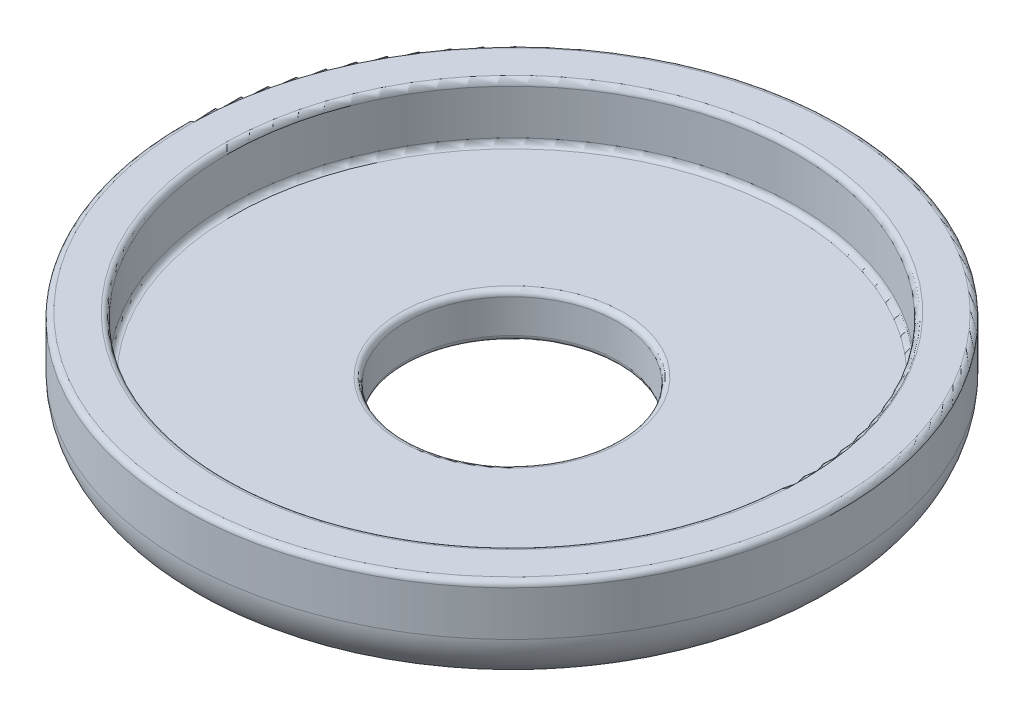
ISO-10303-21;
HEADER;
FILE_DESCRIPTION(('STEP AP214'),'2;1');
FILE_NAME('part.step','',(''),(''),'','','');
FILE_SCHEMA(('AUTOMOTIVE_DESIGN { 1 0 10303 214 1 1 1 1 }'));
ENDSEC;
DATA;
#1=APPLICATION_CONTEXT('core data for automotive mechanical design processes');
#2=APPLICATION_PROTOCOL_DEFINITION('international standard','automotive_design',2000,#1);
#3=PRODUCT_CONTEXT('',#1,'mechanical');
#4=PRODUCT('Part','Part','',(#3));
#5=PRODUCT_RELATED_PRODUCT_CATEGORY('part','',(#4));
#6=PRODUCT_DEFINITION_FORMATION('','',#4);
#7=PRODUCT_DEFINITION_CONTEXT('part definition',#1,'design');
#8=PRODUCT_DEFINITION('design','',#6,#7);
#9=PRODUCT_DEFINITION_SHAPE('','',#8);
#10=(LENGTH_UNIT() NAMED_UNIT(*) SI_UNIT(.MILLI.,.METRE.));
#11=(NAMED_UNIT(*) PLANE_ANGLE_UNIT() SI_UNIT($,.RADIAN.));
#12=(NAMED_UNIT(*) SI_UNIT($,.STERADIAN.) SOLID_ANGLE_UNIT());
#13=UNCERTAINTY_MEASURE_WITH_UNIT(LENGTH_MEASURE(1.E-05),#10,'distance_accuracy_value','');
#14=(GEOMETRIC_REPRESENTATION_CONTEXT(3) GLOBAL_UNCERTAINTY_ASSIGNED_CONTEXT((#13)) GLOBAL_UNIT_ASSIGNED_CONTEXT((#10,
#11,#12)) REPRESENTATION_CONTEXT('',''));
#15=CARTESIAN_POINT('',(0.,0.,0.));
#16=DIRECTION('',(0.,0.,1.));
#17=DIRECTION('',(1.,0.,0.));
#18=AXIS2_PLACEMENT_3D('',#15,#16,#17);
#19=CARTESIAN_POINT('',(0.,2.25,0.));
#20=DIRECTION('',(0.,-1.,0.));
#21=DIRECTION('',(0.,0.,-1.));
#22=AXIS2_PLACEMENT_3D('',#19,#20,#21);
#23=TOROIDAL_SURFACE('',#22,12.5,2.25);
#24=CARTESIAN_POINT('',(0.,2.25,0.));
#25=DIRECTION('',(0.,-1.,0.));
#26=DIRECTION('',(0.,0.,-1.));
#27=AXIS2_PLACEMENT_3D('',#24,#25,#26);
#28=CIRCLE('',#27,14.75);
#29=CARTESIAN_POINT('',(0.,2.25,-14.75));
#30=VERTEX_POINT('',#29);
#31=EDGE_CURVE('E10',#30,#30,#28,.T.);
#32=ORIENTED_EDGE('',*,*,#31,.T.);
#33=EDGE_LOOP('',(#32));
#34=FACE_BOUND('',#33,.T.);
#35=CARTESIAN_POINT('',(0.,0.,0.));
#36=DIRECTION('',(0.,-1.,0.));
#37=DIRECTION('',(0.,0.,-1.));
#38=AXIS2_PLACEMENT_3D('',#35,#36,#37);
#39=CIRCLE('',#38,12.5);
#40=CARTESIAN_POINT('',(0.,0.,-12.5));
#41=VERTEX_POINT('',#40);
#42=EDGE_CURVE('E72',#41,#41,#39,.T.);
#43=ORIENTED_EDGE('',*,*,#42,.F.);
#44=EDGE_LOOP('',(#43));
#45=FACE_BOUND('',#44,.T.);
#46=ADVANCED_FACE('F32',(#34,#45),#23,.T.);
#47=CARTESIAN_POINT('',(0.,0.,0.));
#48=DIRECTION('',(0.,-1.,0.));
#49=DIRECTION('',(0.,0.,-1.));
#50=AXIS2_PLACEMENT_3D('',#47,#48,#49);
#51=CYLINDRICAL_SURFACE('',#50,14.75);
#52=CARTESIAN_POINT('',(0.,4.25,0.));
#53=DIRECTION('',(0.,-1.,0.));
#54=DIRECTION('',(0.,0.,-1.));
#55=AXIS2_PLACEMENT_3D('',#52,#53,#54);
#56=CIRCLE('',#55,14.75);
#57=CARTESIAN_POINT('',(0.,4.25,-14.75));
#58=VERTEX_POINT('',#57);
#59=EDGE_CURVE('E38',#58,#58,#56,.T.);
#60=ORIENTED_EDGE('',*,*,#59,.T.);
#61=EDGE_LOOP('',(#60));
#62=FACE_BOUND('',#61,.T.);
#63=ORIENTED_EDGE('',*,*,#31,.F.);
#64=EDGE_LOOP('',(#63));
#65=FACE_BOUND('',#64,.T.);
#66=ADVANCED_FACE('F81',(#62,#65),#51,.T.);
#67=CARTESIAN_POINT('',(0.,4.25,0.));
#68=DIRECTION('',(0.,-1.,0.));
#69=DIRECTION('',(0.,0.,-1.));
#70=AXIS2_PLACEMENT_3D('',#67,#68,#69);
#71=TOROIDAL_SURFACE('',#70,14.5,0.25);
#72=CARTESIAN_POINT('',(0.,4.5,0.));
#73=DIRECTION('',(0.,-1.,0.));
#74=DIRECTION('',(0.,0.,-1.));
#75=AXIS2_PLACEMENT_3D('',#72,#73,#74);
#76=CIRCLE('',#75,14.5);
#77=CARTESIAN_POINT('',(0.,4.5,-14.5));
#78=VERTEX_POINT('',#77);
#79=EDGE_CURVE('E42',#78,#78,#76,.T.);
#80=ORIENTED_EDGE('',*,*,#79,.T.);
#81=EDGE_LOOP('',(#80));
#82=FACE_BOUND('',#81,.T.);
#83=ORIENTED_EDGE('',*,*,#59,.F.);
#84=EDGE_LOOP('',(#83));
#85=FACE_BOUND('',#84,.T.);
#86=ADVANCED_FACE('F85',(#82,#85),#71,.T.);
#87=CARTESIAN_POINT('',(13.,4.5,0.));
#88=DIRECTION('',(0.,1.,0.));
#89=DIRECTION('',(0.,0.,1.));
#90=AXIS2_PLACEMENT_3D('',#87,#88,#89);
#91=PLANE('',#90);
#92=CARTESIAN_POINT('',(0.,4.5,0.));
#93=DIRECTION('',(0.,-1.,0.));
#94=DIRECTION('',(0.,0.,-1.));
#95=AXIS2_PLACEMENT_3D('',#92,#93,#94);
#96=CIRCLE('',#95,13.);
#97=CARTESIAN_POINT('',(0.,4.5,-13.));
#98=VERTEX_POINT('',#97);
#99=EDGE_CURVE('E46',#98,#98,#96,.T.);
#100=ORIENTED_EDGE('',*,*,#99,.T.);
#101=EDGE_LOOP('',(#100));
#102=FACE_BOUND('',#101,.T.);
#103=ORIENTED_EDGE('',*,*,#79,.F.);
#104=EDGE_LOOP('',(#103));
#105=FACE_BOUND('',#104,.T.);
#106=ADVANCED_FACE('F89',(#102,#105),#91,.T.);
#107=CARTESIAN_POINT('',(0.,4.25,0.));
#108=DIRECTION('',(0.,-1.,0.));
#109=DIRECTION('',(0.,0.,-1.));
#110=AXIS2_PLACEMENT_3D('',#107,#108,#109);
#111=TOROIDAL_SURFACE('',#110,13.,0.25);
#112=CARTESIAN_POINT('',(0.,4.25,0.));
#113=DIRECTION('',(0.,-1.,0.));
#114=DIRECTION('',(0.,0.,-1.));
#115=AXIS2_PLACEMENT_3D('',#112,#113,#114);
#116=CIRCLE('',#115,12.75);
#117=CARTESIAN_POINT('',(0.,4.25,-12.75));
#118=VERTEX_POINT('',#117);
#119=EDGE_CURVE('E51',#118,#118,#116,.T.);
#120=ORIENTED_EDGE('',*,*,#119,.T.);
#121=EDGE_LOOP('',(#120));
#122=FACE_BOUND('',#121,.T.);
#123=ORIENTED_EDGE('',*,*,#99,.F.);
#124=EDGE_LOOP('',(#123));
#125=FACE_BOUND('',#124,.T.);
#126=ADVANCED_FACE('F96',(#122,#125),#111,.T.);
#127=CARTESIAN_POINT('',(0.,0.,0.));
#128=DIRECTION('',(0.,-1.,0.));
#129=DIRECTION('',(0.,0.,-1.));
#130=AXIS2_PLACEMENT_3D('',#127,#128,#129);
#131=CYLINDRICAL_SURFACE('',#130,12.75);
#132=CARTESIAN_POINT('',(0.,2.25,0.));
#133=DIRECTION('',(0.,-1.,0.));
#134=DIRECTION('',(0.,0.,-1.));
#135=AXIS2_PLACEMENT_3D('',#132,#133,#134);
#136=CIRCLE('',#135,12.75);
#137=CARTESIAN_POINT('',(0.,2.25,-12.75));
#138=VERTEX_POINT('',#137);
#139=EDGE_CURVE('E54',#138,#138,#136,.T.);
#140=ORIENTED_EDGE('',*,*,#139,.T.);
#141=EDGE_LOOP('',(#140));
#142=FACE_BOUND('',#141,.T.);
#143=ORIENTED_EDGE('',*,*,#119,.F.);
#144=EDGE_LOOP('',(#143));
#145=FACE_BOUND('',#144,.T.);
#146=ADVANCED_FACE('F100',(#142,#145),#131,.F.);
#147=CARTESIAN_POINT('',(0.,2.25,0.));
#148=DIRECTION('',(0.,-1.,0.));
#149=DIRECTION('',(0.,0.,-1.));
#150=AXIS2_PLACEMENT_3D('',#147,#148,#149);
#151=TOROIDAL_SURFACE('',#150,12.5,0.25);
#152=CARTESIAN_POINT('',(0.,2.,0.));
#153=DIRECTION('',(0.,-1.,0.));
#154=DIRECTION('',(0.,0.,-1.));
#155=AXIS2_PLACEMENT_3D('',#152,#153,#154);
#156=CIRCLE('',#155,12.5);
#157=CARTESIAN_POINT('',(0.,2.,-12.5));
#158=VERTEX_POINT('',#157);
#159=EDGE_CURVE('E57',#158,#158,#156,.T.);
#160=ORIENTED_EDGE('',*,*,#159,.T.);
#161=EDGE_LOOP('',(#160));
#162=FACE_BOUND('',#161,.T.);
#163=ORIENTED_EDGE('',*,*,#139,.F.);
#164=EDGE_LOOP('',(#163));
#165=FACE_BOUND('',#164,.T.);
#166=ADVANCED_FACE('F104',(#162,#165),#151,.F.);
#167=CARTESIAN_POINT('',(12.5,2.,0.));
#168=DIRECTION('',(0.,1.,0.));
#169=DIRECTION('',(0.,0.,1.));
#170=AXIS2_PLACEMENT_3D('',#167,#168,#169);
#171=PLANE('',#170);
#172=CARTESIAN_POINT('',(0.,2.,0.));
#173=DIRECTION('',(0.,-1.,0.));
#174=DIRECTION('',(0.,0.,-1.));
#175=AXIS2_PLACEMENT_3D('',#172,#173,#174);
#176=CIRCLE('',#175,5.);
#177=CARTESIAN_POINT('',(0.,2.,-5.));
#178=VERTEX_POINT('',#177);
#179=EDGE_CURVE('E60',#178,#178,#176,.T.);
#180=ORIENTED_EDGE('',*,*,#179,.T.);
#181=EDGE_LOOP('',(#180));
#182=FACE_BOUND('',#181,.T.);
#183=ORIENTED_EDGE('',*,*,#159,.F.);
#184=EDGE_LOOP('',(#183));
#185=FACE_BOUND('',#184,.T.);
#186=ADVANCED_FACE('F108',(#182,#185),#171,.T.);
#187=CARTESIAN_POINT('',(0.,1.75,0.));
#188=DIRECTION('',(0.,-1.,0.));
#189=DIRECTION('',(0.,0.,-1.));
#190=AXIS2_PLACEMENT_3D('',#187,#188,#189);
#191=TOROIDAL_SURFACE('',#190,5.,0.25);
#192=CARTESIAN_POINT('',(0.,1.75,0.));
#193=DIRECTION('',(0.,-1.,0.));
#194=DIRECTION('',(0.,0.,-1.));
#195=AXIS2_PLACEMENT_3D('',#192,#193,#194);
#196=CIRCLE('',#195,4.75);
#197=CARTESIAN_POINT('',(0.,1.75,-4.75));
#198=VERTEX_POINT('',#197);
#199=EDGE_CURVE('E63',#198,#198,#196,.T.);
#200=ORIENTED_EDGE('',*,*,#199,.T.);
#201=EDGE_LOOP('',(#200));
#202=FACE_BOUND('',#201,.T.);
#203=ORIENTED_EDGE('',*,*,#179,.F.);
#204=EDGE_LOOP('',(#203));
#205=FACE_BOUND('',#204,.T.);
#206=ADVANCED_FACE('F112',(#202,#205),#191,.T.);
#207=CARTESIAN_POINT('',(0.,0.,0.));
#208=DIRECTION('',(0.,-1.,0.));
#209=DIRECTION('',(0.,0.,-1.));
#210=AXIS2_PLACEMENT_3D('',#207,#208,#209);
#211=CYLINDRICAL_SURFACE('',#210,4.75);
#212=CARTESIAN_POINT('',(0.,0.25,0.));
#213=DIRECTION('',(0.,-1.,0.));
#214=DIRECTION('',(0.,0.,-1.));
#215=AXIS2_PLACEMENT_3D('',#212,#213,#214);
#216=CIRCLE('',#215,4.75);
#217=CARTESIAN_POINT('',(0.,0.25,-4.75));
#218=VERTEX_POINT('',#217);
#219=EDGE_CURVE('E66',#218,#218,#216,.T.);
#220=ORIENTED_EDGE('',*,*,#219,.T.);
#221=EDGE_LOOP('',(#220));
#222=FACE_BOUND('',#221,.T.);
#223=ORIENTED_EDGE('',*,*,#199,.F.);
#224=EDGE_LOOP('',(#223));
#225=FACE_BOUND('',#224,.T.);
#226=ADVANCED_FACE('F116',(#222,#225),#211,.F.);
#227=CARTESIAN_POINT('',(0.,0.25,0.));
#228=DIRECTION('',(0.,-1.,0.));
#229=DIRECTION('',(0.,0.,-1.));
#230=AXIS2_PLACEMENT_3D('',#227,#228,#229);
#231=TOROIDAL_SURFACE('',#230,5.,0.25);
#232=CARTESIAN_POINT('',(0.,0.,0.));
#233=DIRECTION('',(0.,-1.,0.));
#234=DIRECTION('',(0.,0.,-1.));
#235=AXIS2_PLACEMENT_3D('',#232,#233,#234);
#236=CIRCLE('',#235,5.);
#237=CARTESIAN_POINT('',(0.,0.,-5.));
#238=VERTEX_POINT('',#237);
#239=EDGE_CURVE('E69',#238,#238,#236,.T.);
#240=ORIENTED_EDGE('',*,*,#239,.T.);
#241=EDGE_LOOP('',(#240));
#242=FACE_BOUND('',#241,.T.);
#243=ORIENTED_EDGE('',*,*,#219,.F.);
#244=EDGE_LOOP('',(#243));
#245=FACE_BOUND('',#244,.T.);
#246=ADVANCED_FACE('F120',(#242,#245),#231,.T.);
#247=CARTESIAN_POINT('',(5.,0.,0.));
#248=DIRECTION('',(0.,-1.,0.));
#249=DIRECTION('',(0.,0.,-1.));
#250=AXIS2_PLACEMENT_3D('',#247,#248,#249);
#251=PLANE('',#250);
#252=ORIENTED_EDGE('',*,*,#42,.T.);
#253=EDGE_LOOP('',(#252));
#254=FACE_BOUND('',#253,.T.);
#255=ORIENTED_EDGE('',*,*,#239,.F.);
#256=EDGE_LOOP('',(#255));
#257=FACE_BOUND('',#256,.T.);
#258=ADVANCED_FACE('F77',(#254,#257),#251,.T.);
#259=CLOSED_SHELL('',(#46,#66,#86,#106,#126,#146,#166,#186,#206,#226,#246,#258));
#260=MANIFOLD_SOLID_BREP('B2',#259);
#261=ADVANCED_BREP_SHAPE_REPRESENTATION('',(#18,#260),#14);
#262=SHAPE_DEFINITION_REPRESENTATION(#9,#261);
ENDSEC;
END-ISO-10303-21;
